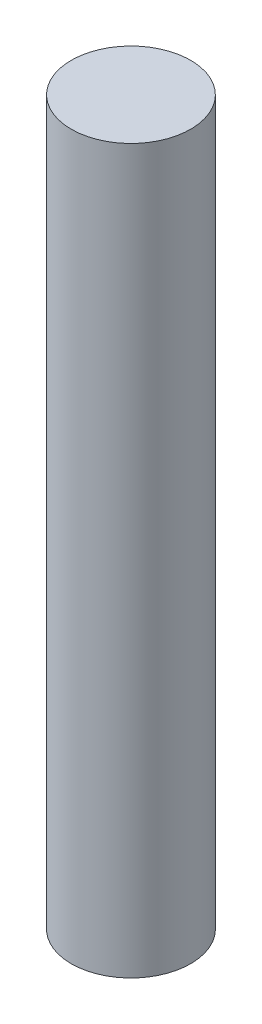
ISO-10303-21;
HEADER;
FILE_DESCRIPTION(('STEP AP214'),'2;1');
FILE_NAME('part.step','',(''),(''),'','','');
FILE_SCHEMA(('AUTOMOTIVE_DESIGN { 1 0 10303 214 1 1 1 1 }'));
ENDSEC;
DATA;
#1=APPLICATION_CONTEXT('core data for automotive mechanical design processes');
#2=APPLICATION_PROTOCOL_DEFINITION('international standard','automotive_design',2000,#1);
#3=PRODUCT_CONTEXT('',#1,'mechanical');
#4=PRODUCT('Part','Part','',(#3));
#5=PRODUCT_RELATED_PRODUCT_CATEGORY('part','',(#4));
#6=PRODUCT_DEFINITION_FORMATION('','',#4);
#7=PRODUCT_DEFINITION_CONTEXT('part definition',#1,'design');
#8=PRODUCT_DEFINITION('design','',#6,#7);
#9=PRODUCT_DEFINITION_SHAPE('','',#8);
#10=(LENGTH_UNIT() NAMED_UNIT(*) SI_UNIT(.MILLI.,.METRE.));
#11=(NAMED_UNIT(*) PLANE_ANGLE_UNIT() SI_UNIT($,.RADIAN.));
#12=(NAMED_UNIT(*) SI_UNIT($,.STERADIAN.) SOLID_ANGLE_UNIT());
#13=UNCERTAINTY_MEASURE_WITH_UNIT(LENGTH_MEASURE(1.E-05),#10,'distance_accuracy_value','');
#14=(GEOMETRIC_REPRESENTATION_CONTEXT(3) GLOBAL_UNCERTAINTY_ASSIGNED_CONTEXT((#13)) GLOBAL_UNIT_ASSIGNED_CONTEXT((#10,
#11,#12)) REPRESENTATION_CONTEXT('',''));
#15=CARTESIAN_POINT('',(0.,0.,0.));
#16=DIRECTION('',(0.,0.,1.));
#17=DIRECTION('',(1.,0.,0.));
#18=AXIS2_PLACEMENT_3D('',#15,#16,#17);
#19=CARTESIAN_POINT('',(0.,115.,0.));
#20=DIRECTION('',(0.,-1.,0.));
#21=DIRECTION('',(0.,0.,-1.));
#22=AXIS2_PLACEMENT_3D('',#19,#20,#21);
#23=CYLINDRICAL_SURFACE('',#22,9.5);
#24=CARTESIAN_POINT('',(0.,115.,0.));
#25=DIRECTION('',(0.,1.,0.));
#26=DIRECTION('',(0.,0.,1.));
#27=AXIS2_PLACEMENT_3D('',#24,#25,#26);
#28=CIRCLE('',#27,9.5);
#29=CARTESIAN_POINT('',(0.,115.,9.5));
#30=VERTEX_POINT('',#29);
#31=EDGE_CURVE('E11',#30,#30,#28,.T.);
#32=ORIENTED_EDGE('',*,*,#31,.F.);
#33=EDGE_LOOP('',(#32));
#34=FACE_BOUND('',#33,.T.);
#35=CARTESIAN_POINT('',(0.,0.,0.));
#36=DIRECTION('',(0.,1.,0.));
#37=DIRECTION('',(0.,0.,1.));
#38=AXIS2_PLACEMENT_3D('',#35,#36,#37);
#39=CIRCLE('',#38,9.5);
#40=CARTESIAN_POINT('',(0.,0.,9.5));
#41=VERTEX_POINT('',#40);
#42=EDGE_CURVE('E45',#41,#41,#39,.T.);
#43=ORIENTED_EDGE('',*,*,#42,.T.);
#44=EDGE_LOOP('',(#43));
#45=FACE_BOUND('',#44,.T.);
#46=ADVANCED_FACE('F42',(#34,#45),#23,.T.);
#47=CARTESIAN_POINT('',(0.,115.,0.));
#48=DIRECTION('',(0.,1.,0.));
#49=DIRECTION('',(0.,0.,1.));
#50=AXIS2_PLACEMENT_3D('',#47,#48,#49);
#51=PLANE('',#50);
#52=ORIENTED_EDGE('',*,*,#31,.T.);
#53=EDGE_LOOP('',(#52));
#54=FACE_BOUND('',#53,.T.);
#55=ADVANCED_FACE('F167',(#54),#51,.T.);
#56=CARTESIAN_POINT('',(0.,0.,0.));
#57=DIRECTION('',(0.,1.,0.));
#58=DIRECTION('',(0.,0.,1.));
#59=AXIS2_PLACEMENT_3D('',#56,#57,#58);
#60=PLANE('',#59);
#61=DIRECTION('',(-1.,0.,0.));
#62=VECTOR('',#61,1.);
#63=CARTESIAN_POINT('',(1.61080725103906,0.,2.79));
#64=LINE('',#63,#62);
#65=CARTESIAN_POINT('',(1.61080725103906,0.,2.79));
#66=VERTEX_POINT('',#65);
#67=CARTESIAN_POINT('',(-1.61080725103906,0.,2.79));
#68=VERTEX_POINT('',#67);
#69=EDGE_CURVE('E130',#66,#68,#64,.T.);
#70=ORIENTED_EDGE('',*,*,#69,.F.);
#71=DIRECTION('',(-0.5,0.,0.866025403784439));
#72=VECTOR('',#71,1.);
#73=CARTESIAN_POINT('',(3.22161450207811,0.,0.));
#74=LINE('',#73,#72);
#75=CARTESIAN_POINT('',(3.22161450207811,0.,0.));
#76=VERTEX_POINT('',#75);
#77=EDGE_CURVE('E56',#76,#66,#74,.T.);
#78=ORIENTED_EDGE('',*,*,#77,.F.);
#79=DIRECTION('',(0.5,0.,0.866025403784439));
#80=VECTOR('',#79,1.);
#81=CARTESIAN_POINT('',(1.61080725103906,0.,-2.79));
#82=LINE('',#81,#80);
#83=CARTESIAN_POINT('',(1.61080725103906,0.,-2.79));
#84=VERTEX_POINT('',#83);
#85=EDGE_CURVE('E139',#84,#76,#82,.T.);
#86=ORIENTED_EDGE('',*,*,#85,.F.);
#87=DIRECTION('',(1.,0.,0.));
#88=VECTOR('',#87,1.);
#89=CARTESIAN_POINT('',(-1.61080725103906,0.,-2.79));
#90=LINE('',#89,#88);
#91=CARTESIAN_POINT('',(-1.61080725103906,0.,-2.79));
#92=VERTEX_POINT('',#91);
#93=EDGE_CURVE('E137',#92,#84,#90,.T.);
#94=ORIENTED_EDGE('',*,*,#93,.F.);
#95=DIRECTION('',(0.5,0.,-0.866025403784439));
#96=VECTOR('',#95,1.);
#97=CARTESIAN_POINT('',(-3.22161450207811,0.,0.));
#98=LINE('',#97,#96);
#99=CARTESIAN_POINT('',(-3.22161450207811,0.,0.));
#100=VERTEX_POINT('',#99);
#101=EDGE_CURVE('E104',#100,#92,#98,.T.);
#102=ORIENTED_EDGE('',*,*,#101,.F.);
#103=DIRECTION('',(-0.5,0.,-0.866025403784439));
#104=VECTOR('',#103,1.);
#105=CARTESIAN_POINT('',(-1.61080725103906,0.,2.79));
#106=LINE('',#105,#104);
#107=EDGE_CURVE('E133',#68,#100,#106,.T.);
#108=ORIENTED_EDGE('',*,*,#107,.F.);
#109=EDGE_LOOP('',(#70,#78,#86,#94,#102,#108));
#110=FACE_BOUND('',#109,.T.);
#111=ORIENTED_EDGE('',*,*,#42,.F.);
#112=EDGE_LOOP('',(#111));
#113=FACE_BOUND('',#112,.T.);
#114=ADVANCED_FACE('F152',(#110,#113),#60,.F.);
#115=CARTESIAN_POINT('',(3.22161450207811,6.6,0.));
#116=DIRECTION('',(0.866025403784438,0.,0.5));
#117=DIRECTION('',(0.5,0.,-0.866025403784438));
#118=AXIS2_PLACEMENT_3D('',#115,#116,#117);
#119=PLANE('',#118);
#120=ORIENTED_EDGE('',*,*,#77,.T.);
#121=DIRECTION('',(0.,-1.,0.));
#122=VECTOR('',#121,1.);
#123=CARTESIAN_POINT('',(1.61080725103906,6.6,2.79));
#124=LINE('',#123,#122);
#125=CARTESIAN_POINT('',(1.61080725103906,6.6,2.79));
#126=VERTEX_POINT('',#125);
#127=EDGE_CURVE('E86',#126,#66,#124,.T.);
#128=ORIENTED_EDGE('',*,*,#127,.F.);
#129=DIRECTION('',(-0.5,0.,0.866025403784439));
#130=VECTOR('',#129,1.);
#131=CARTESIAN_POINT('',(3.22161450207811,6.6,0.));
#132=LINE('',#131,#130);
#133=CARTESIAN_POINT('',(3.22161450207811,6.6,0.));
#134=VERTEX_POINT('',#133);
#135=EDGE_CURVE('E141',#134,#126,#132,.T.);
#136=ORIENTED_EDGE('',*,*,#135,.F.);
#137=DIRECTION('',(0.,-1.,0.));
#138=VECTOR('',#137,1.);
#139=CARTESIAN_POINT('',(3.22161450207811,6.6,0.));
#140=LINE('',#139,#138);
#141=EDGE_CURVE('E64',#134,#76,#140,.T.);
#142=ORIENTED_EDGE('',*,*,#141,.T.);
#143=EDGE_LOOP('',(#120,#128,#136,#142));
#144=FACE_BOUND('',#143,.T.);
#145=ADVANCED_FACE('F158',(#144),#119,.F.);
#146=CARTESIAN_POINT('',(1.61080725103906,6.6,-2.79));
#147=DIRECTION('',(0.866025403784439,0.,-0.5));
#148=DIRECTION('',(-0.5,0.,-0.866025403784438));
#149=AXIS2_PLACEMENT_3D('',#146,#147,#148);
#150=PLANE('',#149);
#151=ORIENTED_EDGE('',*,*,#85,.T.);
#152=ORIENTED_EDGE('',*,*,#141,.F.);
#153=DIRECTION('',(0.5,0.,0.866025403784439));
#154=VECTOR('',#153,1.);
#155=CARTESIAN_POINT('',(1.61080725103906,6.6,-2.79));
#156=LINE('',#155,#154);
#157=CARTESIAN_POINT('',(1.61080725103906,6.6,-2.79));
#158=VERTEX_POINT('',#157);
#159=EDGE_CURVE('E116',#158,#134,#156,.T.);
#160=ORIENTED_EDGE('',*,*,#159,.F.);
#161=DIRECTION('',(0.,-1.,0.));
#162=VECTOR('',#161,1.);
#163=CARTESIAN_POINT('',(1.61080725103906,6.6,-2.79));
#164=LINE('',#163,#162);
#165=EDGE_CURVE('E108',#158,#84,#164,.T.);
#166=ORIENTED_EDGE('',*,*,#165,.T.);
#167=EDGE_LOOP('',(#151,#152,#160,#166));
#168=FACE_BOUND('',#167,.T.);
#169=ADVANCED_FACE('F160',(#168),#150,.F.);
#170=CARTESIAN_POINT('',(-1.61080725103906,6.6,-2.79));
#171=DIRECTION('',(0.,0.,-1.));
#172=DIRECTION('',(-1.,0.,0.));
#173=AXIS2_PLACEMENT_3D('',#170,#171,#172);
#174=PLANE('',#173);
#175=ORIENTED_EDGE('',*,*,#93,.T.);
#176=ORIENTED_EDGE('',*,*,#165,.F.);
#177=DIRECTION('',(1.,0.,0.));
#178=VECTOR('',#177,1.);
#179=CARTESIAN_POINT('',(-1.61080725103906,6.6,-2.79));
#180=LINE('',#179,#178);
#181=CARTESIAN_POINT('',(-1.61080725103906,6.6,-2.79));
#182=VERTEX_POINT('',#181);
#183=EDGE_CURVE('E112',#182,#158,#180,.T.);
#184=ORIENTED_EDGE('',*,*,#183,.F.);
#185=DIRECTION('',(0.,-1.,0.));
#186=VECTOR('',#185,1.);
#187=CARTESIAN_POINT('',(-1.61080725103906,6.6,-2.79));
#188=LINE('',#187,#186);
#189=EDGE_CURVE('E97',#182,#92,#188,.T.);
#190=ORIENTED_EDGE('',*,*,#189,.T.);
#191=EDGE_LOOP('',(#175,#176,#184,#190));
#192=FACE_BOUND('',#191,.T.);
#193=ADVANCED_FACE('F113',(#192),#174,.F.);
#194=CARTESIAN_POINT('',(-3.22161450207811,6.6,0.));
#195=DIRECTION('',(-0.866025403784439,0.,-0.5));
#196=DIRECTION('',(-0.5,0.,0.866025403784438));
#197=AXIS2_PLACEMENT_3D('',#194,#195,#196);
#198=PLANE('',#197);
#199=ORIENTED_EDGE('',*,*,#101,.T.);
#200=ORIENTED_EDGE('',*,*,#189,.F.);
#201=DIRECTION('',(0.5,0.,-0.866025403784439));
#202=VECTOR('',#201,1.);
#203=CARTESIAN_POINT('',(-3.22161450207811,6.6,0.));
#204=LINE('',#203,#202);
#205=CARTESIAN_POINT('',(-3.22161450207811,6.6,0.));
#206=VERTEX_POINT('',#205);
#207=EDGE_CURVE('E101',#206,#182,#204,.T.);
#208=ORIENTED_EDGE('',*,*,#207,.F.);
#209=DIRECTION('',(0.,-1.,0.));
#210=VECTOR('',#209,1.);
#211=CARTESIAN_POINT('',(-3.22161450207811,6.6,0.));
#212=LINE('',#211,#210);
#213=EDGE_CURVE('E109',#206,#100,#212,.T.);
#214=ORIENTED_EDGE('',*,*,#213,.T.);
#215=EDGE_LOOP('',(#199,#200,#208,#214));
#216=FACE_BOUND('',#215,.T.);
#217=ADVANCED_FACE('F99',(#216),#198,.F.);
#218=CARTESIAN_POINT('',(-1.61080725103906,6.6,2.79));
#219=DIRECTION('',(-0.866025403784439,0.,0.5));
#220=DIRECTION('',(0.5,0.,0.866025403784439));
#221=AXIS2_PLACEMENT_3D('',#218,#219,#220);
#222=PLANE('',#221);
#223=ORIENTED_EDGE('',*,*,#107,.T.);
#224=ORIENTED_EDGE('',*,*,#213,.F.);
#225=DIRECTION('',(-0.5,0.,-0.866025403784439));
#226=VECTOR('',#225,1.);
#227=CARTESIAN_POINT('',(-1.61080725103906,6.6,2.79));
#228=LINE('',#227,#226);
#229=CARTESIAN_POINT('',(-1.61080725103906,6.6,2.79));
#230=VERTEX_POINT('',#229);
#231=EDGE_CURVE('E122',#230,#206,#228,.T.);
#232=ORIENTED_EDGE('',*,*,#231,.F.);
#233=DIRECTION('',(0.,-1.,0.));
#234=VECTOR('',#233,1.);
#235=CARTESIAN_POINT('',(-1.61080725103906,6.6,2.79));
#236=LINE('',#235,#234);
#237=EDGE_CURVE('E145',#230,#68,#236,.T.);
#238=ORIENTED_EDGE('',*,*,#237,.T.);
#239=EDGE_LOOP('',(#223,#224,#232,#238));
#240=FACE_BOUND('',#239,.T.);
#241=ADVANCED_FACE('F156',(#240),#222,.F.);
#242=CARTESIAN_POINT('',(1.61080725103906,6.6,2.79));
#243=DIRECTION('',(0.,0.,1.));
#244=DIRECTION('',(1.,0.,0.));
#245=AXIS2_PLACEMENT_3D('',#242,#243,#244);
#246=PLANE('',#245);
#247=ORIENTED_EDGE('',*,*,#69,.T.);
#248=ORIENTED_EDGE('',*,*,#237,.F.);
#249=DIRECTION('',(-1.,0.,0.));
#250=VECTOR('',#249,1.);
#251=CARTESIAN_POINT('',(1.61080725103906,6.6,2.79));
#252=LINE('',#251,#250);
#253=EDGE_CURVE('E124',#126,#230,#252,.T.);
#254=ORIENTED_EDGE('',*,*,#253,.F.);
#255=ORIENTED_EDGE('',*,*,#127,.T.);
#256=EDGE_LOOP('',(#247,#248,#254,#255));
#257=FACE_BOUND('',#256,.T.);
#258=ADVANCED_FACE('F149',(#257),#246,.F.);
#259=CARTESIAN_POINT('',(0.,6.6,0.));
#260=DIRECTION('',(0.,-1.,0.));
#261=DIRECTION('',(0.,0.,-1.));
#262=AXIS2_PLACEMENT_3D('',#259,#260,#261);
#263=PLANE('',#262);
#264=ORIENTED_EDGE('',*,*,#135,.T.);
#265=ORIENTED_EDGE('',*,*,#253,.T.);
#266=ORIENTED_EDGE('',*,*,#231,.T.);
#267=ORIENTED_EDGE('',*,*,#207,.T.);
#268=ORIENTED_EDGE('',*,*,#183,.T.);
#269=ORIENTED_EDGE('',*,*,#159,.T.);
#270=EDGE_LOOP('',(#264,#265,#266,#267,#268,#269));
#271=FACE_BOUND('',#270,.T.);
#272=ADVANCED_FACE('F119',(#271),#263,.T.);
#273=CLOSED_SHELL('',(#46,#55,#114,#145,#169,#193,#217,#241,#258,#272));
#274=MANIFOLD_SOLID_BREP('B2',#273);
#275=ADVANCED_BREP_SHAPE_REPRESENTATION('',(#18,#274),#14);
#276=SHAPE_DEFINITION_REPRESENTATION(#9,#275);
ENDSEC;
END-ISO-10303-21;
